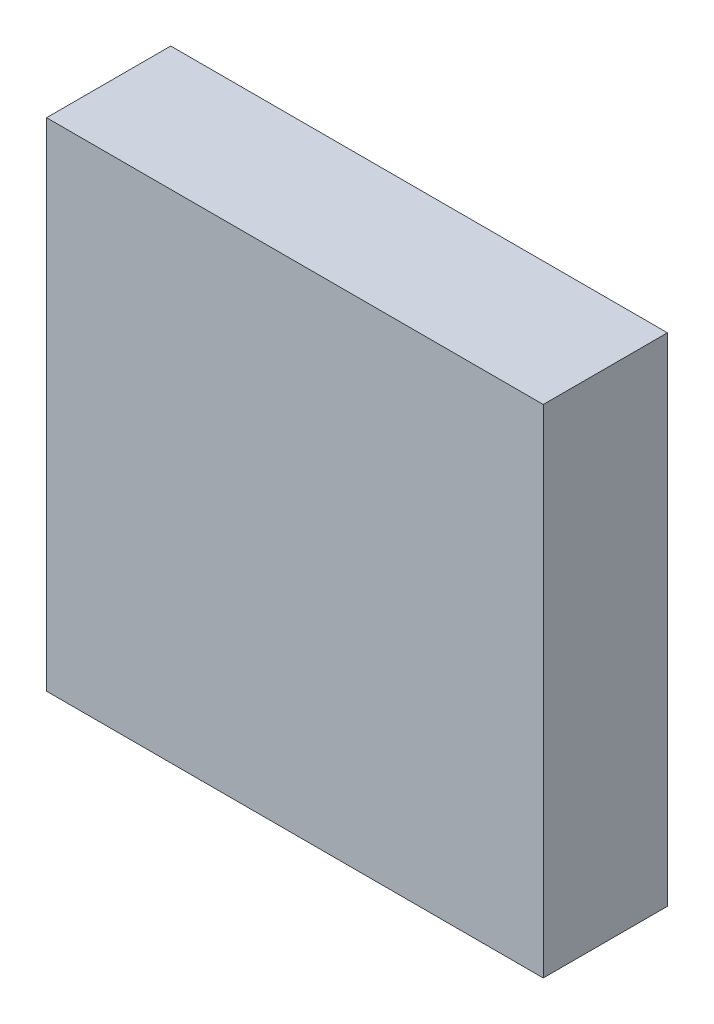
ISO-10303-21;
HEADER;
FILE_DESCRIPTION(('STEP AP214'),'2;1');
FILE_NAME('part.step','',(''),(''),'','','');
FILE_SCHEMA(('AUTOMOTIVE_DESIGN { 1 0 10303 214 1 1 1 1 }'));
ENDSEC;
DATA;
#1=APPLICATION_CONTEXT('core data for automotive mechanical design processes');
#2=APPLICATION_PROTOCOL_DEFINITION('international standard','automotive_design',2000,#1);
#3=PRODUCT_CONTEXT('',#1,'mechanical');
#4=PRODUCT('Part','Part','',(#3));
#5=PRODUCT_RELATED_PRODUCT_CATEGORY('part','',(#4));
#6=PRODUCT_DEFINITION_FORMATION('','',#4);
#7=PRODUCT_DEFINITION_CONTEXT('part definition',#1,'design');
#8=PRODUCT_DEFINITION('design','',#6,#7);
#9=PRODUCT_DEFINITION_SHAPE('','',#8);
#10=(LENGTH_UNIT() NAMED_UNIT(*) SI_UNIT(.MILLI.,.METRE.));
#11=(NAMED_UNIT(*) PLANE_ANGLE_UNIT() SI_UNIT($,.RADIAN.));
#12=(NAMED_UNIT(*) SI_UNIT($,.STERADIAN.) SOLID_ANGLE_UNIT());
#13=UNCERTAINTY_MEASURE_WITH_UNIT(LENGTH_MEASURE(1.E-05),#10,'distance_accuracy_value','');
#14=(GEOMETRIC_REPRESENTATION_CONTEXT(3) GLOBAL_UNCERTAINTY_ASSIGNED_CONTEXT((#13)) GLOBAL_UNIT_ASSIGNED_CONTEXT((#10,
#11,#12)) REPRESENTATION_CONTEXT('',''));
#15=CARTESIAN_POINT('',(0.,0.,0.));
#16=DIRECTION('',(0.,0.,1.));
#17=DIRECTION('',(1.,0.,0.));
#18=AXIS2_PLACEMENT_3D('',#15,#16,#17);
#19=CARTESIAN_POINT('',(20.0000000000004,19.9999999999975,9.999999999999));
#20=DIRECTION('',(-1.,0.,0.));
#21=DIRECTION('',(0.,-0.999999999999979,0.));
#22=AXIS2_PLACEMENT_3D('',#19,#20,#21);
#23=PLANE('',#22);
#24=DIRECTION('',(0.,0.999999999999979,0.));
#25=VECTOR('',#24,1.);
#26=CARTESIAN_POINT('',(19.9999999999999,20.0000000000002,0.));
#27=LINE('',#26,#25);
#28=CARTESIAN_POINT('',(19.9999999999992,-20.,-1.80411241501588E-13));
#29=VERTEX_POINT('',#28);
#30=CARTESIAN_POINT('',(19.9999999999999,20.0000000000002,0.));
#31=VERTEX_POINT('',#30);
#32=EDGE_CURVE('E99',#29,#31,#27,.T.);
#33=ORIENTED_EDGE('',*,*,#32,.T.);
#34=DIRECTION('',(0.,0.,-0.999999999999984));
#35=VECTOR('',#34,1.);
#36=CARTESIAN_POINT('',(20.0000000000004,19.9999999999975,9.999999999999));
#37=LINE('',#36,#35);
#38=CARTESIAN_POINT('',(20.0000000000004,19.9999999999975,9.999999999999));
#39=VERTEX_POINT('',#38);
#40=EDGE_CURVE('E11',#39,#31,#37,.T.);
#41=ORIENTED_EDGE('',*,*,#40,.F.);
#42=DIRECTION('',(0.,0.999999999999979,0.));
#43=VECTOR('',#42,1.);
#44=CARTESIAN_POINT('',(20.0000000000004,19.9999999999975,9.999999999999));
#45=LINE('',#44,#43);
#46=CARTESIAN_POINT('',(19.9999999999991,-20.0000000000006,9.9999999999998));
#47=VERTEX_POINT('',#46);
#48=EDGE_CURVE('E87',#47,#39,#45,.T.);
#49=ORIENTED_EDGE('',*,*,#48,.F.);
#50=DIRECTION('',(0.,0.,-0.999999999999984));
#51=VECTOR('',#50,1.);
#52=CARTESIAN_POINT('',(19.9999999999991,-20.0000000000006,9.9999999999998));
#53=LINE('',#52,#51);
#54=EDGE_CURVE('E95',#47,#29,#53,.T.);
#55=ORIENTED_EDGE('',*,*,#54,.T.);
#56=EDGE_LOOP('',(#33,#41,#49,#55));
#57=FACE_BOUND('',#56,.T.);
#58=ADVANCED_FACE('F36',(#57),#23,.F.);
#59=CARTESIAN_POINT('',(-20.0000000000001,19.9999999999998,9.9999999999999));
#60=DIRECTION('',(0.,-0.999999999999979,0.));
#61=DIRECTION('',(0.,0.,-0.999999999999984));
#62=AXIS2_PLACEMENT_3D('',#59,#60,#61);
#63=PLANE('',#62);
#64=DIRECTION('',(-1.,0.,0.));
#65=VECTOR('',#64,1.);
#66=CARTESIAN_POINT('',(-20.0000000000006,19.9999999999999,1.80411241501588E-13));
#67=LINE('',#66,#65);
#68=CARTESIAN_POINT('',(-20.0000000000006,19.9999999999999,1.80411241501588E-13));
#69=VERTEX_POINT('',#68);
#70=EDGE_CURVE('E91',#31,#69,#67,.T.);
#71=ORIENTED_EDGE('',*,*,#70,.T.);
#72=DIRECTION('',(0.,0.,-0.999999999999984));
#73=VECTOR('',#72,1.);
#74=CARTESIAN_POINT('',(-20.0000000000001,19.9999999999998,9.9999999999999));
#75=LINE('',#74,#73);
#76=CARTESIAN_POINT('',(-20.0000000000001,19.9999999999998,9.9999999999999));
#77=VERTEX_POINT('',#76);
#78=EDGE_CURVE('E44',#77,#69,#75,.T.);
#79=ORIENTED_EDGE('',*,*,#78,.F.);
#80=DIRECTION('',(-1.,0.,0.));
#81=VECTOR('',#80,1.);
#82=CARTESIAN_POINT('',(-20.0000000000001,19.9999999999998,9.9999999999999));
#83=LINE('',#82,#81);
#84=EDGE_CURVE('E82',#39,#77,#83,.T.);
#85=ORIENTED_EDGE('',*,*,#84,.F.);
#86=ORIENTED_EDGE('',*,*,#40,.T.);
#87=EDGE_LOOP('',(#71,#79,#85,#86));
#88=FACE_BOUND('',#87,.T.);
#89=ADVANCED_FACE('F90',(#88),#63,.F.);
#90=CARTESIAN_POINT('',(-20.0000000000001,19.9999999999998,9.9999999999999));
#91=DIRECTION('',(1.,0.,0.));
#92=DIRECTION('',(0.,0.999999999999979,0.));
#93=AXIS2_PLACEMENT_3D('',#90,#91,#92);
#94=PLANE('',#93);
#95=DIRECTION('',(0.,-0.999999999999979,0.));
#96=VECTOR('',#95,1.);
#97=CARTESIAN_POINT('',(-20.0000000000006,19.9999999999999,1.80411241501588E-13));
#98=LINE('',#97,#96);
#99=CARTESIAN_POINT('',(-20.0000000000011,-20.0000000000001,1.38777878078145E-13));
#100=VERTEX_POINT('',#99);
#101=EDGE_CURVE('E69',#69,#100,#98,.T.);
#102=ORIENTED_EDGE('',*,*,#101,.T.);
#103=DIRECTION('',(0.,0.,-0.999999999999984));
#104=VECTOR('',#103,1.);
#105=CARTESIAN_POINT('',(-19.9999999999994,-20.0000000000001,9.99999999999995));
#106=LINE('',#105,#104);
#107=CARTESIAN_POINT('',(-19.9999999999994,-20.0000000000001,9.99999999999995));
#108=VERTEX_POINT('',#107);
#109=EDGE_CURVE('E92',#108,#100,#106,.T.);
#110=ORIENTED_EDGE('',*,*,#109,.F.);
#111=DIRECTION('',(0.,-0.999999999999979,0.));
#112=VECTOR('',#111,1.);
#113=CARTESIAN_POINT('',(-20.0000000000001,19.9999999999998,9.9999999999999));
#114=LINE('',#113,#112);
#115=EDGE_CURVE('E85',#77,#108,#114,.T.);
#116=ORIENTED_EDGE('',*,*,#115,.F.);
#117=ORIENTED_EDGE('',*,*,#78,.T.);
#118=EDGE_LOOP('',(#102,#110,#116,#117));
#119=FACE_BOUND('',#118,.T.);
#120=ADVANCED_FACE('F93',(#119),#94,.F.);
#121=CARTESIAN_POINT('',(-19.9999999999994,-20.0000000000001,9.99999999999995));
#122=DIRECTION('',(0.,0.999999999999979,0.));
#123=DIRECTION('',(0.,0.,0.999999999999984));
#124=AXIS2_PLACEMENT_3D('',#121,#122,#123);
#125=PLANE('',#124);
#126=DIRECTION('',(1.,0.,0.));
#127=VECTOR('',#126,1.);
#128=CARTESIAN_POINT('',(-20.0000000000011,-20.0000000000001,1.38777878078145E-13));
#129=LINE('',#128,#127);
#130=EDGE_CURVE('E75',#100,#29,#129,.T.);
#131=ORIENTED_EDGE('',*,*,#130,.T.);
#132=ORIENTED_EDGE('',*,*,#54,.F.);
#133=DIRECTION('',(1.,0.,0.));
#134=VECTOR('',#133,1.);
#135=CARTESIAN_POINT('',(-19.9999999999994,-20.0000000000001,9.99999999999995));
#136=LINE('',#135,#134);
#137=EDGE_CURVE('E52',#108,#47,#136,.T.);
#138=ORIENTED_EDGE('',*,*,#137,.F.);
#139=ORIENTED_EDGE('',*,*,#109,.T.);
#140=EDGE_LOOP('',(#131,#132,#138,#139));
#141=FACE_BOUND('',#140,.T.);
#142=ADVANCED_FACE('F106',(#141),#125,.F.);
#143=CARTESIAN_POINT('',(-1.33226762955019E-12,4.57966997657877E-13,9.99999999999983));
#144=DIRECTION('',(0.,0.,0.999999999999984));
#145=DIRECTION('',(1.,0.,0.));
#146=AXIS2_PLACEMENT_3D('',#143,#144,#145);
#147=PLANE('',#146);
#148=ORIENTED_EDGE('',*,*,#48,.T.);
#149=ORIENTED_EDGE('',*,*,#84,.T.);
#150=ORIENTED_EDGE('',*,*,#115,.T.);
#151=ORIENTED_EDGE('',*,*,#137,.T.);
#152=EDGE_LOOP('',(#148,#149,#150,#151));
#153=FACE_BOUND('',#152,.T.);
#154=ADVANCED_FACE('F83',(#153),#147,.T.);
#155=CARTESIAN_POINT('',(0.,0.,0.));
#156=DIRECTION('',(0.,0.,0.999999999999984));
#157=DIRECTION('',(1.,0.,0.));
#158=AXIS2_PLACEMENT_3D('',#155,#156,#157);
#159=PLANE('',#158);
#160=ORIENTED_EDGE('',*,*,#32,.F.);
#161=ORIENTED_EDGE('',*,*,#130,.F.);
#162=ORIENTED_EDGE('',*,*,#101,.F.);
#163=ORIENTED_EDGE('',*,*,#70,.F.);
#164=EDGE_LOOP('',(#160,#161,#162,#163));
#165=FACE_BOUND('',#164,.T.);
#166=ADVANCED_FACE('F109',(#165),#159,.F.);
#167=CLOSED_SHELL('',(#58,#89,#120,#142,#154,#166));
#168=MANIFOLD_SOLID_BREP('B2',#167);
#169=ADVANCED_BREP_SHAPE_REPRESENTATION('',(#18,#168),#14);
#170=SHAPE_DEFINITION_REPRESENTATION(#9,#169);
ENDSEC;
END-ISO-10303-21;
